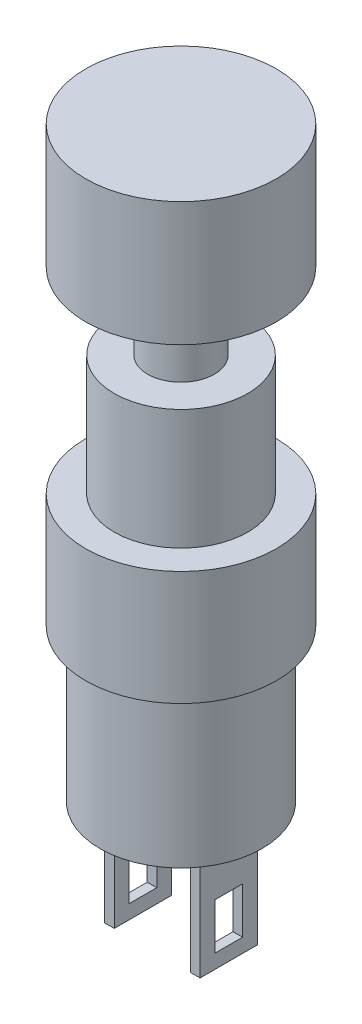
ISO-10303-21;
HEADER;
FILE_DESCRIPTION(('STEP AP214'),'2;1');
FILE_NAME('part.step','',(''),(''),'','','');
FILE_SCHEMA(('AUTOMOTIVE_DESIGN { 1 0 10303 214 1 1 1 1 }'));
ENDSEC;
DATA;
#1=APPLICATION_CONTEXT('core data for automotive mechanical design processes');
#2=APPLICATION_PROTOCOL_DEFINITION('international standard','automotive_design',2000,#1);
#3=PRODUCT_CONTEXT('',#1,'mechanical');
#4=PRODUCT('Part','Part','',(#3));
#5=PRODUCT_RELATED_PRODUCT_CATEGORY('part','',(#4));
#6=PRODUCT_DEFINITION_FORMATION('','',#4);
#7=PRODUCT_DEFINITION_CONTEXT('part definition',#1,'design');
#8=PRODUCT_DEFINITION('design','',#6,#7);
#9=PRODUCT_DEFINITION_SHAPE('','',#8);
#10=(LENGTH_UNIT() NAMED_UNIT(*) SI_UNIT(.MILLI.,.METRE.));
#11=(NAMED_UNIT(*) PLANE_ANGLE_UNIT() SI_UNIT($,.RADIAN.));
#12=(NAMED_UNIT(*) SI_UNIT($,.STERADIAN.) SOLID_ANGLE_UNIT());
#13=UNCERTAINTY_MEASURE_WITH_UNIT(LENGTH_MEASURE(1.E-05),#10,'distance_accuracy_value','');
#14=(GEOMETRIC_REPRESENTATION_CONTEXT(3) GLOBAL_UNCERTAINTY_ASSIGNED_CONTEXT((#13)) GLOBAL_UNIT_ASSIGNED_CONTEXT((#10,
#11,#12)) REPRESENTATION_CONTEXT('',''));
#15=CARTESIAN_POINT('',(0.,0.,0.));
#16=DIRECTION('',(0.,0.,1.));
#17=DIRECTION('',(1.,0.,0.));
#18=AXIS2_PLACEMENT_3D('',#15,#16,#17);
#19=CARTESIAN_POINT('',(0.,12.3,0.));
#20=DIRECTION('',(0.,1.,0.));
#21=DIRECTION('',(0.,0.,1.));
#22=AXIS2_PLACEMENT_3D('',#19,#20,#21);
#23=PLANE('',#22);
#24=CARTESIAN_POINT('',(0.,12.3,0.));
#25=DIRECTION('',(0.,1.,0.));
#26=DIRECTION('',(0.,0.,1.));
#27=AXIS2_PLACEMENT_3D('',#24,#25,#26);
#28=CIRCLE('',#27,3.5);
#29=CARTESIAN_POINT('',(0.,12.3,3.5));
#30=VERTEX_POINT('',#29);
#31=EDGE_CURVE('E602',#30,#30,#28,.T.);
#32=ORIENTED_EDGE('',*,*,#31,.T.);
#33=EDGE_LOOP('',(#32));
#34=FACE_BOUND('',#33,.T.);
#35=CARTESIAN_POINT('',(0.,12.3,0.));
#36=DIRECTION('',(0.,1.,0.));
#37=DIRECTION('',(0.,0.,1.));
#38=AXIS2_PLACEMENT_3D('',#35,#36,#37);
#39=CIRCLE('',#38,1.75);
#40=CARTESIAN_POINT('',(0.,12.3,1.75));
#41=VERTEX_POINT('',#40);
#42=EDGE_CURVE('E590',#41,#41,#39,.T.);
#43=ORIENTED_EDGE('',*,*,#42,.F.);
#44=EDGE_LOOP('',(#43));
#45=FACE_BOUND('',#44,.T.);
#46=ADVANCED_FACE('F31',(#34,#45),#23,.T.);
#47=CARTESIAN_POINT('',(0.,6.,0.));
#48=DIRECTION('',(0.,1.,0.));
#49=DIRECTION('',(0.,0.,1.));
#50=AXIS2_PLACEMENT_3D('',#47,#48,#49);
#51=PLANE('',#50);
#52=CARTESIAN_POINT('',(0.,6.,0.));
#53=DIRECTION('',(0.,1.,0.));
#54=DIRECTION('',(0.,0.,1.));
#55=AXIS2_PLACEMENT_3D('',#52,#53,#54);
#56=CIRCLE('',#55,5.);
#57=CARTESIAN_POINT('',(0.,6.,5.));
#58=VERTEX_POINT('',#57);
#59=EDGE_CURVE('E39',#58,#58,#56,.T.);
#60=ORIENTED_EDGE('',*,*,#59,.T.);
#61=EDGE_LOOP('',(#60));
#62=FACE_BOUND('',#61,.T.);
#63=CARTESIAN_POINT('',(0.,6.,0.));
#64=DIRECTION('',(0.,1.,0.));
#65=DIRECTION('',(0.,0.,1.));
#66=AXIS2_PLACEMENT_3D('',#63,#64,#65);
#67=CIRCLE('',#66,3.5);
#68=CARTESIAN_POINT('',(0.,6.,3.5));
#69=VERTEX_POINT('',#68);
#70=EDGE_CURVE('E600',#69,#69,#67,.T.);
#71=ORIENTED_EDGE('',*,*,#70,.F.);
#72=EDGE_LOOP('',(#71));
#73=FACE_BOUND('',#72,.T.);
#74=ADVANCED_FACE('F303',(#62,#73),#51,.T.);
#75=CARTESIAN_POINT('',(0.,-8.,0.));
#76=DIRECTION('',(0.,-1.,0.));
#77=DIRECTION('',(0.,0.,-1.));
#78=AXIS2_PLACEMENT_3D('',#75,#76,#77);
#79=PLANE('',#78);
#80=DIRECTION('',(-1.,0.,0.));
#81=VECTOR('',#80,1.);
#82=CARTESIAN_POINT('',(2.,-8.,1.5));
#83=LINE('',#82,#81);
#84=CARTESIAN_POINT('',(2.5,-8.,1.5));
#85=VERTEX_POINT('',#84);
#86=CARTESIAN_POINT('',(2.,-8.,1.5));
#87=VERTEX_POINT('',#86);
#88=EDGE_CURVE('E256',#85,#87,#83,.T.);
#89=ORIENTED_EDGE('',*,*,#88,.F.);
#90=DIRECTION('',(0.,0.,1.));
#91=VECTOR('',#90,1.);
#92=CARTESIAN_POINT('',(2.5,-8.,-1.5));
#93=LINE('',#92,#91);
#94=CARTESIAN_POINT('',(2.5,-8.,-1.5));
#95=VERTEX_POINT('',#94);
#96=EDGE_CURVE('E242',#95,#85,#93,.T.);
#97=ORIENTED_EDGE('',*,*,#96,.F.);
#98=DIRECTION('',(1.,0.,0.));
#99=VECTOR('',#98,1.);
#100=CARTESIAN_POINT('',(2.,-8.,-1.5));
#101=LINE('',#100,#99);
#102=CARTESIAN_POINT('',(2.,-8.,-1.5));
#103=VERTEX_POINT('',#102);
#104=EDGE_CURVE('E247',#103,#95,#101,.T.);
#105=ORIENTED_EDGE('',*,*,#104,.F.);
#106=DIRECTION('',(0.,0.,-1.));
#107=VECTOR('',#106,1.);
#108=CARTESIAN_POINT('',(2.,-8.,-1.5));
#109=LINE('',#108,#107);
#110=EDGE_CURVE('E258',#87,#103,#109,.T.);
#111=ORIENTED_EDGE('',*,*,#110,.F.);
#112=EDGE_LOOP('',(#89,#97,#105,#111));
#113=FACE_BOUND('',#112,.T.);
#114=CARTESIAN_POINT('',(0.,-8.,0.));
#115=DIRECTION('',(0.,-1.,0.));
#116=DIRECTION('',(0.,0.,-1.));
#117=AXIS2_PLACEMENT_3D('',#114,#115,#116);
#118=CIRCLE('',#117,4.25);
#119=CARTESIAN_POINT('',(0.,-8.,-4.25));
#120=VERTEX_POINT('',#119);
#121=EDGE_CURVE('E271',#120,#120,#118,.T.);
#122=ORIENTED_EDGE('',*,*,#121,.T.);
#123=EDGE_LOOP('',(#122));
#124=FACE_BOUND('',#123,.T.);
#125=DIRECTION('',(-1.,0.,0.));
#126=VECTOR('',#125,1.);
#127=CARTESIAN_POINT('',(-2.,-8.,1.5));
#128=LINE('',#127,#126);
#129=CARTESIAN_POINT('',(-2.,-8.,1.5));
#130=VERTEX_POINT('',#129);
#131=CARTESIAN_POINT('',(-2.5,-8.,1.5));
#132=VERTEX_POINT('',#131);
#133=EDGE_CURVE('E227',#130,#132,#128,.T.);
#134=ORIENTED_EDGE('',*,*,#133,.F.);
#135=DIRECTION('',(0.,0.,1.));
#136=VECTOR('',#135,1.);
#137=CARTESIAN_POINT('',(-2.,-8.,-1.5));
#138=LINE('',#137,#136);
#139=CARTESIAN_POINT('',(-2.,-8.,-1.5));
#140=VERTEX_POINT('',#139);
#141=EDGE_CURVE('E213',#140,#130,#138,.T.);
#142=ORIENTED_EDGE('',*,*,#141,.F.);
#143=DIRECTION('',(1.,0.,0.));
#144=VECTOR('',#143,1.);
#145=CARTESIAN_POINT('',(-2.,-8.,-1.5));
#146=LINE('',#145,#144);
#147=CARTESIAN_POINT('',(-2.5,-8.,-1.5));
#148=VERTEX_POINT('',#147);
#149=EDGE_CURVE('E218',#148,#140,#146,.T.);
#150=ORIENTED_EDGE('',*,*,#149,.F.);
#151=DIRECTION('',(0.,0.,-1.));
#152=VECTOR('',#151,1.);
#153=CARTESIAN_POINT('',(-2.5,-8.,-1.5));
#154=LINE('',#153,#152);
#155=EDGE_CURVE('E229',#132,#148,#154,.T.);
#156=ORIENTED_EDGE('',*,*,#155,.F.);
#157=EDGE_LOOP('',(#134,#142,#150,#156));
#158=FACE_BOUND('',#157,.T.);
#159=ADVANCED_FACE('F283',(#113,#124,#158),#79,.T.);
#160=CARTESIAN_POINT('',(0.,0.,0.));
#161=DIRECTION('',(0.,1.,0.));
#162=DIRECTION('',(0.,0.,1.));
#163=AXIS2_PLACEMENT_3D('',#160,#161,#162);
#164=PLANE('',#163);
#165=CARTESIAN_POINT('',(0.,0.,0.));
#166=DIRECTION('',(0.,1.,0.));
#167=DIRECTION('',(0.,0.,1.));
#168=AXIS2_PLACEMENT_3D('',#165,#166,#167);
#169=CIRCLE('',#168,5.);
#170=CARTESIAN_POINT('',(0.,0.,5.));
#171=VERTEX_POINT('',#170);
#172=EDGE_CURVE('E274',#171,#171,#169,.T.);
#173=ORIENTED_EDGE('',*,*,#172,.F.);
#174=EDGE_LOOP('',(#173));
#175=FACE_BOUND('',#174,.T.);
#176=CARTESIAN_POINT('',(0.,0.,0.));
#177=DIRECTION('',(0.,1.,0.));
#178=DIRECTION('',(0.,0.,1.));
#179=AXIS2_PLACEMENT_3D('',#176,#177,#178);
#180=CIRCLE('',#179,4.25);
#181=CARTESIAN_POINT('',(0.,0.,4.25));
#182=VERTEX_POINT('',#181);
#183=EDGE_CURVE('E11',#182,#182,#180,.F.);
#184=ORIENTED_EDGE('',*,*,#183,.F.);
#185=EDGE_LOOP('',(#184));
#186=FACE_BOUND('',#185,.T.);
#187=ADVANCED_FACE('F280',(#175,#186),#164,.F.);
#188=CARTESIAN_POINT('',(0.,6.,0.));
#189=DIRECTION('',(0.,-1.,0.));
#190=DIRECTION('',(0.,0.,-1.));
#191=AXIS2_PLACEMENT_3D('',#188,#189,#190);
#192=CYLINDRICAL_SURFACE('',#191,5.);
#193=ORIENTED_EDGE('',*,*,#59,.F.);
#194=EDGE_LOOP('',(#193));
#195=FACE_BOUND('',#194,.T.);
#196=ORIENTED_EDGE('',*,*,#172,.T.);
#197=EDGE_LOOP('',(#196));
#198=FACE_BOUND('',#197,.T.);
#199=ADVANCED_FACE('F33',(#195,#198),#192,.T.);
#200=CARTESIAN_POINT('',(0.,-8.,0.));
#201=DIRECTION('',(0.,1.,0.));
#202=DIRECTION('',(0.,0.,1.));
#203=AXIS2_PLACEMENT_3D('',#200,#201,#202);
#204=CYLINDRICAL_SURFACE('',#203,4.25);
#205=ORIENTED_EDGE('',*,*,#121,.F.);
#206=EDGE_LOOP('',(#205));
#207=FACE_BOUND('',#206,.T.);
#208=ORIENTED_EDGE('',*,*,#183,.T.);
#209=EDGE_LOOP('',(#208));
#210=FACE_BOUND('',#209,.T.);
#211=ADVANCED_FACE('F286',(#207,#210),#204,.T.);
#212=CARTESIAN_POINT('',(2.5,-14.,-1.5));
#213=DIRECTION('',(-1.,0.,0.));
#214=DIRECTION('',(0.,0.,1.));
#215=AXIS2_PLACEMENT_3D('',#212,#213,#214);
#216=PLANE('',#215);
#217=DIRECTION('',(0.,0.,-1.));
#218=VECTOR('',#217,1.);
#219=CARTESIAN_POINT('',(2.5,-10.8387417934711,-1.5));
#220=LINE('',#219,#218);
#221=CARTESIAN_POINT('',(2.5,-10.8387417934711,0.71438599194853));
#222=VERTEX_POINT('',#221);
#223=CARTESIAN_POINT('',(2.5,-10.8387417934711,-0.728581274216814));
#224=VERTEX_POINT('',#223);
#225=EDGE_CURVE('E201',#222,#224,#220,.T.);
#226=ORIENTED_EDGE('',*,*,#225,.T.);
#227=DIRECTION('',(0.,-1.,0.));
#228=VECTOR('',#227,1.);
#229=CARTESIAN_POINT('',(2.5,-14.,-0.728581274216814));
#230=LINE('',#229,#228);
#231=CARTESIAN_POINT('',(2.5,-13.2621868174154,-0.728581274216814));
#232=VERTEX_POINT('',#231);
#233=EDGE_CURVE('E210',#224,#232,#230,.T.);
#234=ORIENTED_EDGE('',*,*,#233,.T.);
#235=DIRECTION('',(0.,0.,1.));
#236=VECTOR('',#235,1.);
#237=CARTESIAN_POINT('',(2.5,-13.2621868174154,-1.5));
#238=LINE('',#237,#236);
#239=CARTESIAN_POINT('',(2.5,-13.2621868174154,0.714385991948531));
#240=VERTEX_POINT('',#239);
#241=EDGE_CURVE('E185',#232,#240,#238,.T.);
#242=ORIENTED_EDGE('',*,*,#241,.T.);
#243=DIRECTION('',(0.,1.,0.));
#244=VECTOR('',#243,1.);
#245=CARTESIAN_POINT('',(2.5,-14.,0.71438599194853));
#246=LINE('',#245,#244);
#247=EDGE_CURVE('E192',#240,#222,#246,.T.);
#248=ORIENTED_EDGE('',*,*,#247,.T.);
#249=EDGE_LOOP('',(#226,#234,#242,#248));
#250=FACE_BOUND('',#249,.T.);
#251=ORIENTED_EDGE('',*,*,#96,.T.);
#252=DIRECTION('',(0.,1.,0.));
#253=VECTOR('',#252,1.);
#254=CARTESIAN_POINT('',(2.5,-14.,1.5));
#255=LINE('',#254,#253);
#256=CARTESIAN_POINT('',(2.5,-14.,1.5));
#257=VERTEX_POINT('',#256);
#258=EDGE_CURVE('E269',#257,#85,#255,.T.);
#259=ORIENTED_EDGE('',*,*,#258,.F.);
#260=DIRECTION('',(0.,0.,1.));
#261=VECTOR('',#260,1.);
#262=CARTESIAN_POINT('',(2.5,-14.,-1.5));
#263=LINE('',#262,#261);
#264=CARTESIAN_POINT('',(2.5,-14.,-1.5));
#265=VERTEX_POINT('',#264);
#266=EDGE_CURVE('E243',#265,#257,#263,.T.);
#267=ORIENTED_EDGE('',*,*,#266,.F.);
#268=DIRECTION('',(0.,1.,0.));
#269=VECTOR('',#268,1.);
#270=CARTESIAN_POINT('',(2.5,-14.,-1.5));
#271=LINE('',#270,#269);
#272=EDGE_CURVE('E253',#265,#95,#271,.T.);
#273=ORIENTED_EDGE('',*,*,#272,.T.);
#274=EDGE_LOOP('',(#251,#259,#267,#273));
#275=FACE_BOUND('',#274,.T.);
#276=ADVANCED_FACE('F288',(#250,#275),#216,.F.);
#277=CARTESIAN_POINT('',(2.,-14.,1.5));
#278=DIRECTION('',(0.,0.,-1.));
#279=DIRECTION('',(-1.,0.,0.));
#280=AXIS2_PLACEMENT_3D('',#277,#278,#279);
#281=PLANE('',#280);
#282=ORIENTED_EDGE('',*,*,#88,.T.);
#283=DIRECTION('',(0.,1.,0.));
#284=VECTOR('',#283,1.);
#285=CARTESIAN_POINT('',(2.,-14.,1.5));
#286=LINE('',#285,#284);
#287=CARTESIAN_POINT('',(2.,-14.,1.5));
#288=VERTEX_POINT('',#287);
#289=EDGE_CURVE('E266',#288,#87,#286,.T.);
#290=ORIENTED_EDGE('',*,*,#289,.F.);
#291=DIRECTION('',(-1.,0.,0.));
#292=VECTOR('',#291,1.);
#293=CARTESIAN_POINT('',(2.,-14.,1.5));
#294=LINE('',#293,#292);
#295=EDGE_CURVE('E246',#257,#288,#294,.T.);
#296=ORIENTED_EDGE('',*,*,#295,.F.);
#297=ORIENTED_EDGE('',*,*,#258,.T.);
#298=EDGE_LOOP('',(#282,#290,#296,#297));
#299=FACE_BOUND('',#298,.T.);
#300=ADVANCED_FACE('F295',(#299),#281,.F.);
#301=CARTESIAN_POINT('',(2.,-14.,-1.5));
#302=DIRECTION('',(1.,0.,0.));
#303=DIRECTION('',(0.,0.,-1.));
#304=AXIS2_PLACEMENT_3D('',#301,#302,#303);
#305=PLANE('',#304);
#306=DIRECTION('',(0.,0.,-1.));
#307=VECTOR('',#306,1.);
#308=CARTESIAN_POINT('',(2.,-13.2621868174154,-1.5));
#309=LINE('',#308,#307);
#310=CARTESIAN_POINT('',(2.,-13.2621868174154,0.71438599194853));
#311=VERTEX_POINT('',#310);
#312=CARTESIAN_POINT('',(2.,-13.2621868174154,-0.728581274216815));
#313=VERTEX_POINT('',#312);
#314=EDGE_CURVE('E182',#311,#313,#309,.T.);
#315=ORIENTED_EDGE('',*,*,#314,.T.);
#316=DIRECTION('',(0.,1.,0.));
#317=VECTOR('',#316,1.);
#318=CARTESIAN_POINT('',(2.,-14.,-0.728581274216814));
#319=LINE('',#318,#317);
#320=CARTESIAN_POINT('',(2.,-10.8387417934711,-0.728581274216814));
#321=VERTEX_POINT('',#320);
#322=EDGE_CURVE('E207',#313,#321,#319,.T.);
#323=ORIENTED_EDGE('',*,*,#322,.T.);
#324=DIRECTION('',(0.,0.,1.));
#325=VECTOR('',#324,1.);
#326=CARTESIAN_POINT('',(2.,-10.8387417934711,-1.5));
#327=LINE('',#326,#325);
#328=CARTESIAN_POINT('',(2.,-10.8387417934711,0.71438599194853));
#329=VERTEX_POINT('',#328);
#330=EDGE_CURVE('E198',#321,#329,#327,.T.);
#331=ORIENTED_EDGE('',*,*,#330,.T.);
#332=DIRECTION('',(0.,-1.,0.));
#333=VECTOR('',#332,1.);
#334=CARTESIAN_POINT('',(2.,-14.,0.71438599194853));
#335=LINE('',#334,#333);
#336=EDGE_CURVE('E189',#329,#311,#335,.T.);
#337=ORIENTED_EDGE('',*,*,#336,.T.);
#338=EDGE_LOOP('',(#315,#323,#331,#337));
#339=FACE_BOUND('',#338,.T.);
#340=ORIENTED_EDGE('',*,*,#110,.T.);
#341=DIRECTION('',(0.,1.,0.));
#342=VECTOR('',#341,1.);
#343=CARTESIAN_POINT('',(2.,-14.,-1.5));
#344=LINE('',#343,#342);
#345=CARTESIAN_POINT('',(2.,-14.,-1.5));
#346=VERTEX_POINT('',#345);
#347=EDGE_CURVE('E264',#346,#103,#344,.T.);
#348=ORIENTED_EDGE('',*,*,#347,.F.);
#349=DIRECTION('',(0.,0.,-1.));
#350=VECTOR('',#349,1.);
#351=CARTESIAN_POINT('',(2.,-14.,-1.5));
#352=LINE('',#351,#350);
#353=EDGE_CURVE('E249',#288,#346,#352,.T.);
#354=ORIENTED_EDGE('',*,*,#353,.F.);
#355=ORIENTED_EDGE('',*,*,#289,.T.);
#356=EDGE_LOOP('',(#340,#348,#354,#355));
#357=FACE_BOUND('',#356,.T.);
#358=ADVANCED_FACE('F362',(#339,#357),#305,.F.);
#359=CARTESIAN_POINT('',(2.,-14.,-1.5));
#360=DIRECTION('',(0.,0.,1.));
#361=DIRECTION('',(1.,0.,0.));
#362=AXIS2_PLACEMENT_3D('',#359,#360,#361);
#363=PLANE('',#362);
#364=ORIENTED_EDGE('',*,*,#104,.T.);
#365=ORIENTED_EDGE('',*,*,#272,.F.);
#366=DIRECTION('',(1.,0.,0.));
#367=VECTOR('',#366,1.);
#368=CARTESIAN_POINT('',(2.,-14.,-1.5));
#369=LINE('',#368,#367);
#370=EDGE_CURVE('E251',#346,#265,#369,.T.);
#371=ORIENTED_EDGE('',*,*,#370,.F.);
#372=ORIENTED_EDGE('',*,*,#347,.T.);
#373=EDGE_LOOP('',(#364,#365,#371,#372));
#374=FACE_BOUND('',#373,.T.);
#375=ADVANCED_FACE('F358',(#374),#363,.F.);
#376=CARTESIAN_POINT('',(2.5,-14.,1.5));
#377=DIRECTION('',(0.,1.,0.));
#378=DIRECTION('',(0.,0.,1.));
#379=AXIS2_PLACEMENT_3D('',#376,#377,#378);
#380=PLANE('',#379);
#381=ORIENTED_EDGE('',*,*,#266,.T.);
#382=ORIENTED_EDGE('',*,*,#295,.T.);
#383=ORIENTED_EDGE('',*,*,#353,.T.);
#384=ORIENTED_EDGE('',*,*,#370,.T.);
#385=EDGE_LOOP('',(#381,#382,#383,#384));
#386=FACE_BOUND('',#385,.T.);
#387=ADVANCED_FACE('F354',(#386),#380,.F.);
#388=CARTESIAN_POINT('',(-2.,-14.,-1.5));
#389=DIRECTION('',(-1.,0.,0.));
#390=DIRECTION('',(0.,0.,1.));
#391=AXIS2_PLACEMENT_3D('',#388,#389,#390);
#392=PLANE('',#391);
#393=DIRECTION('',(0.,0.,-1.));
#394=VECTOR('',#393,1.);
#395=CARTESIAN_POINT('',(-2.,-10.8387417934711,-1.5));
#396=LINE('',#395,#394);
#397=CARTESIAN_POINT('',(-2.,-10.8387417934711,0.714385991948529));
#398=VERTEX_POINT('',#397);
#399=CARTESIAN_POINT('',(-2.,-10.8387417934711,-0.728581274216815));
#400=VERTEX_POINT('',#399);
#401=EDGE_CURVE('E195',#398,#400,#396,.T.);
#402=ORIENTED_EDGE('',*,*,#401,.T.);
#403=DIRECTION('',(0.,-1.,0.));
#404=VECTOR('',#403,1.);
#405=CARTESIAN_POINT('',(-2.,-14.,-0.728581274216815));
#406=LINE('',#405,#404);
#407=CARTESIAN_POINT('',(-2.,-13.2621868174154,-0.728581274216815));
#408=VERTEX_POINT('',#407);
#409=EDGE_CURVE('E204',#400,#408,#406,.T.);
#410=ORIENTED_EDGE('',*,*,#409,.T.);
#411=DIRECTION('',(0.,0.,1.));
#412=VECTOR('',#411,1.);
#413=CARTESIAN_POINT('',(-2.,-13.2621868174154,-1.5));
#414=LINE('',#413,#412);
#415=CARTESIAN_POINT('',(-2.,-13.2621868174154,0.714385991948531));
#416=VERTEX_POINT('',#415);
#417=EDGE_CURVE('E180',#408,#416,#414,.T.);
#418=ORIENTED_EDGE('',*,*,#417,.T.);
#419=DIRECTION('',(0.,1.,0.));
#420=VECTOR('',#419,1.);
#421=CARTESIAN_POINT('',(-2.,-14.,0.714385991948529));
#422=LINE('',#421,#420);
#423=EDGE_CURVE('E151',#416,#398,#422,.T.);
#424=ORIENTED_EDGE('',*,*,#423,.T.);
#425=EDGE_LOOP('',(#402,#410,#418,#424));
#426=FACE_BOUND('',#425,.T.);
#427=ORIENTED_EDGE('',*,*,#141,.T.);
#428=DIRECTION('',(0.,1.,0.));
#429=VECTOR('',#428,1.);
#430=CARTESIAN_POINT('',(-2.,-14.,1.5));
#431=LINE('',#430,#429);
#432=CARTESIAN_POINT('',(-2.,-14.,1.5));
#433=VERTEX_POINT('',#432);
#434=EDGE_CURVE('E240',#433,#130,#431,.T.);
#435=ORIENTED_EDGE('',*,*,#434,.F.);
#436=DIRECTION('',(0.,0.,1.));
#437=VECTOR('',#436,1.);
#438=CARTESIAN_POINT('',(-2.,-14.,-1.5));
#439=LINE('',#438,#437);
#440=CARTESIAN_POINT('',(-2.,-14.,-1.5));
#441=VERTEX_POINT('',#440);
#442=EDGE_CURVE('E214',#441,#433,#439,.T.);
#443=ORIENTED_EDGE('',*,*,#442,.F.);
#444=DIRECTION('',(0.,1.,0.));
#445=VECTOR('',#444,1.);
#446=CARTESIAN_POINT('',(-2.,-14.,-1.5));
#447=LINE('',#446,#445);
#448=EDGE_CURVE('E224',#441,#140,#447,.T.);
#449=ORIENTED_EDGE('',*,*,#448,.T.);
#450=EDGE_LOOP('',(#427,#435,#443,#449));
#451=FACE_BOUND('',#450,.T.);
#452=ADVANCED_FACE('F350',(#426,#451),#392,.F.);
#453=CARTESIAN_POINT('',(-2.,-14.,1.5));
#454=DIRECTION('',(0.,0.,-1.));
#455=DIRECTION('',(-1.,0.,0.));
#456=AXIS2_PLACEMENT_3D('',#453,#454,#455);
#457=PLANE('',#456);
#458=ORIENTED_EDGE('',*,*,#133,.T.);
#459=DIRECTION('',(0.,1.,0.));
#460=VECTOR('',#459,1.);
#461=CARTESIAN_POINT('',(-2.5,-14.,1.5));
#462=LINE('',#461,#460);
#463=CARTESIAN_POINT('',(-2.5,-14.,1.5));
#464=VERTEX_POINT('',#463);
#465=EDGE_CURVE('E237',#464,#132,#462,.T.);
#466=ORIENTED_EDGE('',*,*,#465,.F.);
#467=DIRECTION('',(-1.,0.,0.));
#468=VECTOR('',#467,1.);
#469=CARTESIAN_POINT('',(-2.,-14.,1.5));
#470=LINE('',#469,#468);
#471=EDGE_CURVE('E217',#433,#464,#470,.T.);
#472=ORIENTED_EDGE('',*,*,#471,.F.);
#473=ORIENTED_EDGE('',*,*,#434,.T.);
#474=EDGE_LOOP('',(#458,#466,#472,#473));
#475=FACE_BOUND('',#474,.T.);
#476=ADVANCED_FACE('F347',(#475),#457,.F.);
#477=CARTESIAN_POINT('',(-2.5,-14.,-1.5));
#478=DIRECTION('',(1.,0.,0.));
#479=DIRECTION('',(0.,0.,-1.));
#480=AXIS2_PLACEMENT_3D('',#477,#478,#479);
#481=PLANE('',#480);
#482=DIRECTION('',(0.,0.,1.));
#483=VECTOR('',#482,1.);
#484=CARTESIAN_POINT('',(-2.5,-13.2621868174154,-0.728581274216815));
#485=LINE('',#484,#483);
#486=CARTESIAN_POINT('',(-2.5,-13.2621868174154,-0.728581274216815));
#487=VERTEX_POINT('',#486);
#488=CARTESIAN_POINT('',(-2.5,-13.2621868174154,0.714385991948529));
#489=VERTEX_POINT('',#488);
#490=EDGE_CURVE('E157',#487,#489,#485,.T.);
#491=ORIENTED_EDGE('',*,*,#490,.F.);
#492=DIRECTION('',(0.,-1.,0.));
#493=VECTOR('',#492,1.);
#494=CARTESIAN_POINT('',(-2.5,-13.2621868174154,-0.728581274216815));
#495=LINE('',#494,#493);
#496=CARTESIAN_POINT('',(-2.5,-10.8387417934711,-0.728581274216815));
#497=VERTEX_POINT('',#496);
#498=EDGE_CURVE('E163',#497,#487,#495,.T.);
#499=ORIENTED_EDGE('',*,*,#498,.F.);
#500=DIRECTION('',(0.,0.,-1.));
#501=VECTOR('',#500,1.);
#502=CARTESIAN_POINT('',(-2.5,-10.8387417934711,-0.728581274216815));
#503=LINE('',#502,#501);
#504=CARTESIAN_POINT('',(-2.5,-10.8387417934711,0.714385991948529));
#505=VERTEX_POINT('',#504);
#506=EDGE_CURVE('E168',#505,#497,#503,.T.);
#507=ORIENTED_EDGE('',*,*,#506,.F.);
#508=DIRECTION('',(0.,1.,0.));
#509=VECTOR('',#508,1.);
#510=CARTESIAN_POINT('',(-2.5,-13.2621868174154,0.714385991948529));
#511=LINE('',#510,#509);
#512=EDGE_CURVE('E148',#489,#505,#511,.T.);
#513=ORIENTED_EDGE('',*,*,#512,.F.);
#514=EDGE_LOOP('',(#491,#499,#507,#513));
#515=FACE_BOUND('',#514,.T.);
#516=ORIENTED_EDGE('',*,*,#155,.T.);
#517=DIRECTION('',(0.,1.,0.));
#518=VECTOR('',#517,1.);
#519=CARTESIAN_POINT('',(-2.5,-14.,-1.5));
#520=LINE('',#519,#518);
#521=CARTESIAN_POINT('',(-2.5,-14.,-1.5));
#522=VERTEX_POINT('',#521);
#523=EDGE_CURVE('E235',#522,#148,#520,.T.);
#524=ORIENTED_EDGE('',*,*,#523,.F.);
#525=DIRECTION('',(0.,0.,-1.));
#526=VECTOR('',#525,1.);
#527=CARTESIAN_POINT('',(-2.5,-14.,-1.5));
#528=LINE('',#527,#526);
#529=EDGE_CURVE('E220',#464,#522,#528,.T.);
#530=ORIENTED_EDGE('',*,*,#529,.F.);
#531=ORIENTED_EDGE('',*,*,#465,.T.);
#532=EDGE_LOOP('',(#516,#524,#530,#531));
#533=FACE_BOUND('',#532,.T.);
#534=ADVANCED_FACE('F165',(#515,#533),#481,.F.);
#535=CARTESIAN_POINT('',(-2.,-14.,-1.5));
#536=DIRECTION('',(0.,0.,1.));
#537=DIRECTION('',(1.,0.,0.));
#538=AXIS2_PLACEMENT_3D('',#535,#536,#537);
#539=PLANE('',#538);
#540=ORIENTED_EDGE('',*,*,#149,.T.);
#541=ORIENTED_EDGE('',*,*,#448,.F.);
#542=DIRECTION('',(1.,0.,0.));
#543=VECTOR('',#542,1.);
#544=CARTESIAN_POINT('',(-2.,-14.,-1.5));
#545=LINE('',#544,#543);
#546=EDGE_CURVE('E222',#522,#441,#545,.T.);
#547=ORIENTED_EDGE('',*,*,#546,.F.);
#548=ORIENTED_EDGE('',*,*,#523,.T.);
#549=EDGE_LOOP('',(#540,#541,#547,#548));
#550=FACE_BOUND('',#549,.T.);
#551=ADVANCED_FACE('F340',(#550),#539,.F.);
#552=CARTESIAN_POINT('',(-2.,-14.,1.5));
#553=DIRECTION('',(0.,-1.,0.));
#554=DIRECTION('',(0.,0.,-1.));
#555=AXIS2_PLACEMENT_3D('',#552,#553,#554);
#556=PLANE('',#555);
#557=ORIENTED_EDGE('',*,*,#442,.T.);
#558=ORIENTED_EDGE('',*,*,#471,.T.);
#559=ORIENTED_EDGE('',*,*,#529,.T.);
#560=ORIENTED_EDGE('',*,*,#546,.T.);
#561=EDGE_LOOP('',(#557,#558,#559,#560));
#562=FACE_BOUND('',#561,.T.);
#563=ADVANCED_FACE('F337',(#562),#556,.T.);
#564=CARTESIAN_POINT('',(5.,-13.2621868174154,-0.728581274216813));
#565=DIRECTION('',(0.,-1.,0.));
#566=DIRECTION('',(0.,0.,-1.));
#567=AXIS2_PLACEMENT_3D('',#564,#565,#566);
#568=PLANE('',#567);
#569=DIRECTION('',(-1.,0.,0.));
#570=VECTOR('',#569,1.);
#571=CARTESIAN_POINT('',(5.,-13.2621868174154,-0.728581274216813));
#572=LINE('',#571,#570);
#573=EDGE_CURVE('E160',#408,#487,#572,.T.);
#574=ORIENTED_EDGE('',*,*,#573,.T.);
#575=ORIENTED_EDGE('',*,*,#490,.T.);
#576=DIRECTION('',(-1.,0.,0.));
#577=VECTOR('',#576,1.);
#578=CARTESIAN_POINT('',(5.,-13.2621868174154,0.714385991948531));
#579=LINE('',#578,#577);
#580=EDGE_CURVE('E143',#416,#489,#579,.T.);
#581=ORIENTED_EDGE('',*,*,#580,.F.);
#582=ORIENTED_EDGE('',*,*,#417,.F.);
#583=EDGE_LOOP('',(#574,#575,#581,#582));
#584=FACE_BOUND('',#583,.T.);
#585=ADVANCED_FACE('F158',(#584),#568,.F.);
#586=CARTESIAN_POINT('',(5.,-13.2621868174154,0.714385991948531));
#587=DIRECTION('',(0.,0.,1.));
#588=DIRECTION('',(1.,0.,0.));
#589=AXIS2_PLACEMENT_3D('',#586,#587,#588);
#590=PLANE('',#589);
#591=ORIENTED_EDGE('',*,*,#580,.T.);
#592=ORIENTED_EDGE('',*,*,#512,.T.);
#593=DIRECTION('',(-1.,0.,0.));
#594=VECTOR('',#593,1.);
#595=CARTESIAN_POINT('',(5.,-10.8387417934711,0.714385991948531));
#596=LINE('',#595,#594);
#597=EDGE_CURVE('E177',#398,#505,#596,.T.);
#598=ORIENTED_EDGE('',*,*,#597,.F.);
#599=ORIENTED_EDGE('',*,*,#423,.F.);
#600=EDGE_LOOP('',(#591,#592,#598,#599));
#601=FACE_BOUND('',#600,.T.);
#602=ADVANCED_FACE('F145',(#601),#590,.F.);
#603=CARTESIAN_POINT('',(5.,-10.8387417934711,-0.728581274216813));
#604=DIRECTION('',(0.,1.,0.));
#605=DIRECTION('',(0.,0.,1.));
#606=AXIS2_PLACEMENT_3D('',#603,#604,#605);
#607=PLANE('',#606);
#608=ORIENTED_EDGE('',*,*,#597,.T.);
#609=ORIENTED_EDGE('',*,*,#506,.T.);
#610=DIRECTION('',(-1.,0.,0.));
#611=VECTOR('',#610,1.);
#612=CARTESIAN_POINT('',(5.,-10.8387417934711,-0.728581274216813));
#613=LINE('',#612,#611);
#614=EDGE_CURVE('E173',#400,#497,#613,.T.);
#615=ORIENTED_EDGE('',*,*,#614,.F.);
#616=ORIENTED_EDGE('',*,*,#401,.F.);
#617=EDGE_LOOP('',(#608,#609,#615,#616));
#618=FACE_BOUND('',#617,.T.);
#619=ADVANCED_FACE('F327',(#618),#607,.F.);
#620=CARTESIAN_POINT('',(5.,-13.2621868174154,-0.728581274216813));
#621=DIRECTION('',(0.,0.,-1.));
#622=DIRECTION('',(-1.,0.,0.));
#623=AXIS2_PLACEMENT_3D('',#620,#621,#622);
#624=PLANE('',#623);
#625=ORIENTED_EDGE('',*,*,#614,.T.);
#626=ORIENTED_EDGE('',*,*,#498,.T.);
#627=ORIENTED_EDGE('',*,*,#573,.F.);
#628=ORIENTED_EDGE('',*,*,#409,.F.);
#629=EDGE_LOOP('',(#625,#626,#627,#628));
#630=FACE_BOUND('',#629,.T.);
#631=ADVANCED_FACE('F335',(#630),#624,.F.);
#632=EDGE_CURVE('E175',#224,#321,#613,.T.);
#633=ORIENTED_EDGE('',*,*,#632,.T.);
#634=ORIENTED_EDGE('',*,*,#322,.F.);
#635=EDGE_CURVE('E51',#232,#313,#572,.T.);
#636=ORIENTED_EDGE('',*,*,#635,.F.);
#637=ORIENTED_EDGE('',*,*,#233,.F.);
#638=EDGE_LOOP('',(#633,#634,#636,#637));
#639=FACE_BOUND('',#638,.T.);
#640=ADVANCED_FACE('F325',(#639),#624,.F.);
#641=EDGE_CURVE('E176',#222,#329,#596,.T.);
#642=ORIENTED_EDGE('',*,*,#641,.T.);
#643=ORIENTED_EDGE('',*,*,#330,.F.);
#644=ORIENTED_EDGE('',*,*,#632,.F.);
#645=ORIENTED_EDGE('',*,*,#225,.F.);
#646=EDGE_LOOP('',(#642,#643,#644,#645));
#647=FACE_BOUND('',#646,.T.);
#648=ADVANCED_FACE('F321',(#647),#607,.F.);
#649=EDGE_CURVE('E46',#240,#311,#579,.T.);
#650=ORIENTED_EDGE('',*,*,#649,.T.);
#651=ORIENTED_EDGE('',*,*,#336,.F.);
#652=ORIENTED_EDGE('',*,*,#641,.F.);
#653=ORIENTED_EDGE('',*,*,#247,.F.);
#654=EDGE_LOOP('',(#650,#651,#652,#653));
#655=FACE_BOUND('',#654,.T.);
#656=ADVANCED_FACE('F324',(#655),#590,.F.);
#657=ORIENTED_EDGE('',*,*,#635,.T.);
#658=ORIENTED_EDGE('',*,*,#314,.F.);
#659=ORIENTED_EDGE('',*,*,#649,.F.);
#660=ORIENTED_EDGE('',*,*,#241,.F.);
#661=EDGE_LOOP('',(#657,#658,#659,#660));
#662=FACE_BOUND('',#661,.T.);
#663=ADVANCED_FACE('F319',(#662),#568,.F.);
#664=CARTESIAN_POINT('',(0.,12.3,0.));
#665=DIRECTION('',(0.,-1.,0.));
#666=DIRECTION('',(0.,0.,-1.));
#667=AXIS2_PLACEMENT_3D('',#664,#665,#666);
#668=CYLINDRICAL_SURFACE('',#667,3.5);
#669=ORIENTED_EDGE('',*,*,#31,.F.);
#670=EDGE_LOOP('',(#669));
#671=FACE_BOUND('',#670,.T.);
#672=ORIENTED_EDGE('',*,*,#70,.T.);
#673=EDGE_LOOP('',(#672));
#674=FACE_BOUND('',#673,.T.);
#675=ADVANCED_FACE('F316',(#671,#674),#668,.T.);
#676=CARTESIAN_POINT('',(0.,16.3,0.));
#677=DIRECTION('',(0.,-1.,0.));
#678=DIRECTION('',(0.,0.,-1.));
#679=AXIS2_PLACEMENT_3D('',#676,#677,#678);
#680=CYLINDRICAL_SURFACE('',#679,1.75);
#681=CARTESIAN_POINT('',(0.,16.3,0.));
#682=DIRECTION('',(0.,1.,0.));
#683=DIRECTION('',(0.,0.,1.));
#684=AXIS2_PLACEMENT_3D('',#681,#682,#683);
#685=CIRCLE('',#684,1.75);
#686=CARTESIAN_POINT('',(0.,16.3,1.75));
#687=VERTEX_POINT('',#686);
#688=EDGE_CURVE('E594',#687,#687,#685,.T.);
#689=ORIENTED_EDGE('',*,*,#688,.F.);
#690=EDGE_LOOP('',(#689));
#691=FACE_BOUND('',#690,.T.);
#692=ORIENTED_EDGE('',*,*,#42,.T.);
#693=EDGE_LOOP('',(#692));
#694=FACE_BOUND('',#693,.T.);
#695=ADVANCED_FACE('F314',(#691,#694),#680,.T.);
#696=CARTESIAN_POINT('',(0.,16.3,0.));
#697=DIRECTION('',(0.,1.,0.));
#698=DIRECTION('',(0.,0.,1.));
#699=AXIS2_PLACEMENT_3D('',#696,#697,#698);
#700=PLANE('',#699);
#701=CARTESIAN_POINT('',(0.,16.3,0.));
#702=DIRECTION('',(0.,1.,0.));
#703=DIRECTION('',(0.,0.,1.));
#704=AXIS2_PLACEMENT_3D('',#701,#702,#703);
#705=CIRCLE('',#704,5.);
#706=CARTESIAN_POINT('',(0.,16.3,5.));
#707=VERTEX_POINT('',#706);
#708=EDGE_CURVE('E591',#707,#707,#705,.T.);
#709=ORIENTED_EDGE('',*,*,#708,.F.);
#710=EDGE_LOOP('',(#709));
#711=FACE_BOUND('',#710,.T.);
#712=ORIENTED_EDGE('',*,*,#688,.T.);
#713=EDGE_LOOP('',(#712));
#714=FACE_BOUND('',#713,.T.);
#715=ADVANCED_FACE('F537',(#711,#714),#700,.F.);
#716=CARTESIAN_POINT('',(0.,22.8,0.));
#717=DIRECTION('',(0.,-1.,0.));
#718=DIRECTION('',(0.,0.,-1.));
#719=AXIS2_PLACEMENT_3D('',#716,#717,#718);
#720=CYLINDRICAL_SURFACE('',#719,5.);
#721=CARTESIAN_POINT('',(0.,22.8,0.));
#722=DIRECTION('',(0.,1.,0.));
#723=DIRECTION('',(0.,0.,1.));
#724=AXIS2_PLACEMENT_3D('',#721,#722,#723);
#725=CIRCLE('',#724,5.);
#726=CARTESIAN_POINT('',(0.,22.8,5.));
#727=VERTEX_POINT('',#726);
#728=EDGE_CURVE('E589',#727,#727,#725,.T.);
#729=ORIENTED_EDGE('',*,*,#728,.F.);
#730=EDGE_LOOP('',(#729));
#731=FACE_BOUND('',#730,.T.);
#732=ORIENTED_EDGE('',*,*,#708,.T.);
#733=EDGE_LOOP('',(#732));
#734=FACE_BOUND('',#733,.T.);
#735=ADVANCED_FACE('F545',(#731,#734),#720,.T.);
#736=CARTESIAN_POINT('',(0.,22.8,0.));
#737=DIRECTION('',(0.,1.,0.));
#738=DIRECTION('',(0.,0.,1.));
#739=AXIS2_PLACEMENT_3D('',#736,#737,#738);
#740=PLANE('',#739);
#741=ORIENTED_EDGE('',*,*,#728,.T.);
#742=EDGE_LOOP('',(#741));
#743=FACE_BOUND('',#742,.T.);
#744=ADVANCED_FACE('F554',(#743),#740,.T.);
#745=CLOSED_SHELL('',(#46,#74,#159,#187,#199,#211,#276,#300,#358,#375,#387,#452,#476,#534,#551,
#563,#585,#602,#619,#631,#640,#648,#656,#663,#675,#695,#715,#735,#744));
#746=MANIFOLD_SOLID_BREP('B2',#745);
#747=ADVANCED_BREP_SHAPE_REPRESENTATION('',(#18,#746),#14);
#748=SHAPE_DEFINITION_REPRESENTATION(#9,#747);
ENDSEC;
END-ISO-10303-21;
